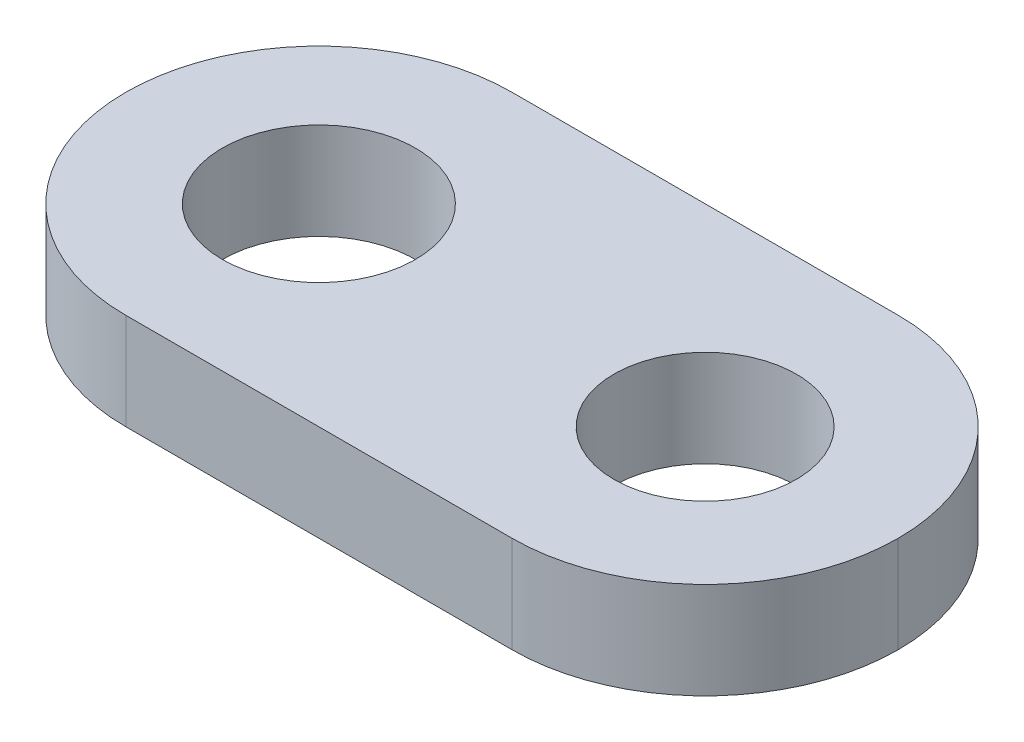
ISO-10303-21;
HEADER;
FILE_DESCRIPTION(('STEP AP214'),'2;1');
FILE_NAME('part.step','',(''),(''),'','','');
FILE_SCHEMA(('AUTOMOTIVE_DESIGN { 1 0 10303 214 1 1 1 1 }'));
ENDSEC;
DATA;
#1=APPLICATION_CONTEXT('core data for automotive mechanical design processes');
#2=APPLICATION_PROTOCOL_DEFINITION('international standard','automotive_design',2000,#1);
#3=PRODUCT_CONTEXT('',#1,'mechanical');
#4=PRODUCT('Part','Part','',(#3));
#5=PRODUCT_RELATED_PRODUCT_CATEGORY('part','',(#4));
#6=PRODUCT_DEFINITION_FORMATION('','',#4);
#7=PRODUCT_DEFINITION_CONTEXT('part definition',#1,'design');
#8=PRODUCT_DEFINITION('design','',#6,#7);
#9=PRODUCT_DEFINITION_SHAPE('','',#8);
#10=(LENGTH_UNIT() NAMED_UNIT(*) SI_UNIT(.MILLI.,.METRE.));
#11=(NAMED_UNIT(*) PLANE_ANGLE_UNIT() SI_UNIT($,.RADIAN.));
#12=(NAMED_UNIT(*) SI_UNIT($,.STERADIAN.) SOLID_ANGLE_UNIT());
#13=UNCERTAINTY_MEASURE_WITH_UNIT(LENGTH_MEASURE(1.E-05),#10,'distance_accuracy_value','');
#14=(GEOMETRIC_REPRESENTATION_CONTEXT(3) GLOBAL_UNCERTAINTY_ASSIGNED_CONTEXT((#13)) GLOBAL_UNIT_ASSIGNED_CONTEXT((#10,
#11,#12)) REPRESENTATION_CONTEXT('',''));
#15=CARTESIAN_POINT('',(0.,0.,0.));
#16=DIRECTION('',(0.,0.,1.));
#17=DIRECTION('',(1.,0.,0.));
#18=AXIS2_PLACEMENT_3D('',#15,#16,#17);
#19=CARTESIAN_POINT('',(0.,3.175,0.));
#20=DIRECTION('',(0.,-1.,0.));
#21=DIRECTION('',(0.,0.,-1.));
#22=AXIS2_PLACEMENT_3D('',#19,#20,#21);
#23=PLANE('',#22);
#24=DIRECTION('',(1.,0.,0.));
#25=VECTOR('',#24,1.);
#26=CARTESIAN_POINT('',(0.,3.175,0.));
#27=LINE('',#26,#25);
#28=CARTESIAN_POINT('',(6.35,3.175,0.));
#29=VERTEX_POINT('',#28);
#30=CARTESIAN_POINT('',(19.05,3.175,0.));
#31=VERTEX_POINT('',#30);
#32=EDGE_CURVE('E143',#29,#31,#27,.T.);
#33=ORIENTED_EDGE('',*,*,#32,.T.);
#34=CARTESIAN_POINT('',(19.05,3.175,-6.35));
#35=DIRECTION('',(0.,-1.,0.));
#36=DIRECTION('',(0.,0.,-1.));
#37=AXIS2_PLACEMENT_3D('',#34,#35,#36);
#38=CIRCLE('',#37,6.35);
#39=CARTESIAN_POINT('',(25.4,3.175,-6.35));
#40=VERTEX_POINT('',#39);
#41=EDGE_CURVE('E123',#31,#40,#38,.F.);
#42=ORIENTED_EDGE('',*,*,#41,.T.);
#43=CARTESIAN_POINT('',(19.05,3.175,-6.35));
#44=DIRECTION('',(0.,-1.,0.));
#45=DIRECTION('',(0.,0.,-1.));
#46=AXIS2_PLACEMENT_3D('',#43,#44,#45);
#47=CIRCLE('',#46,6.35);
#48=CARTESIAN_POINT('',(19.05,3.175,-12.7));
#49=VERTEX_POINT('',#48);
#50=EDGE_CURVE('E59',#40,#49,#47,.F.);
#51=ORIENTED_EDGE('',*,*,#50,.T.);
#52=DIRECTION('',(-1.,0.,0.));
#53=VECTOR('',#52,1.);
#54=CARTESIAN_POINT('',(0.,3.175,-12.7));
#55=LINE('',#54,#53);
#56=CARTESIAN_POINT('',(6.35,3.175,-12.7));
#57=VERTEX_POINT('',#56);
#58=EDGE_CURVE('E102',#49,#57,#55,.T.);
#59=ORIENTED_EDGE('',*,*,#58,.T.);
#60=CARTESIAN_POINT('',(6.35,3.175,-6.35));
#61=DIRECTION('',(0.,-1.,0.));
#62=DIRECTION('',(0.,0.,-1.));
#63=AXIS2_PLACEMENT_3D('',#60,#61,#62);
#64=CIRCLE('',#63,6.35);
#65=CARTESIAN_POINT('',(0.,3.175,-6.35));
#66=VERTEX_POINT('',#65);
#67=EDGE_CURVE('E51',#57,#66,#64,.F.);
#68=ORIENTED_EDGE('',*,*,#67,.T.);
#69=CARTESIAN_POINT('',(6.35,3.175,-6.35));
#70=DIRECTION('',(0.,-1.,0.));
#71=DIRECTION('',(0.,0.,-1.));
#72=AXIS2_PLACEMENT_3D('',#69,#70,#71);
#73=CIRCLE('',#72,6.35);
#74=EDGE_CURVE('E105',#66,#29,#73,.F.);
#75=ORIENTED_EDGE('',*,*,#74,.T.);
#76=EDGE_LOOP('',(#33,#42,#51,#59,#68,#75));
#77=FACE_BOUND('',#76,.T.);
#78=CARTESIAN_POINT('',(19.05,3.175,-6.35));
#79=DIRECTION('',(0.,1.,0.));
#80=DIRECTION('',(0.,0.,1.));
#81=AXIS2_PLACEMENT_3D('',#78,#79,#80);
#82=CIRCLE('',#81,2.99999999999999);
#83=CARTESIAN_POINT('',(19.05,3.175,-3.35000000000001));
#84=VERTEX_POINT('',#83);
#85=EDGE_CURVE('E138',#84,#84,#82,.T.);
#86=ORIENTED_EDGE('',*,*,#85,.F.);
#87=EDGE_LOOP('',(#86));
#88=FACE_BOUND('',#87,.T.);
#89=CARTESIAN_POINT('',(6.35,3.175,-6.35));
#90=DIRECTION('',(0.,1.,0.));
#91=DIRECTION('',(0.,0.,1.));
#92=AXIS2_PLACEMENT_3D('',#89,#90,#91);
#93=CIRCLE('',#92,3.175);
#94=CARTESIAN_POINT('',(6.35,3.175,-3.175));
#95=VERTEX_POINT('',#94);
#96=EDGE_CURVE('E131',#95,#95,#93,.T.);
#97=ORIENTED_EDGE('',*,*,#96,.F.);
#98=EDGE_LOOP('',(#97));
#99=FACE_BOUND('',#98,.T.);
#100=ADVANCED_FACE('F34',(#77,#88,#99),#23,.F.);
#101=CARTESIAN_POINT('',(0.,0.,0.));
#102=DIRECTION('',(0.,-1.,0.));
#103=DIRECTION('',(0.,0.,-1.));
#104=AXIS2_PLACEMENT_3D('',#101,#102,#103);
#105=PLANE('',#104);
#106=CARTESIAN_POINT('',(19.05,0.,-6.35));
#107=DIRECTION('',(0.,1.,0.));
#108=DIRECTION('',(0.,0.,1.));
#109=AXIS2_PLACEMENT_3D('',#106,#107,#108);
#110=CIRCLE('',#109,2.99999999999999);
#111=CARTESIAN_POINT('',(19.05,0.,-3.35000000000001));
#112=VERTEX_POINT('',#111);
#113=EDGE_CURVE('E135',#112,#112,#110,.T.);
#114=ORIENTED_EDGE('',*,*,#113,.T.);
#115=EDGE_LOOP('',(#114));
#116=FACE_BOUND('',#115,.T.);
#117=CARTESIAN_POINT('',(19.05,0.,-6.35));
#118=DIRECTION('',(0.,-1.,0.));
#119=DIRECTION('',(0.,0.,-1.));
#120=AXIS2_PLACEMENT_3D('',#117,#118,#119);
#121=CIRCLE('',#120,6.35);
#122=CARTESIAN_POINT('',(19.05,0.,-12.7));
#123=VERTEX_POINT('',#122);
#124=CARTESIAN_POINT('',(25.4,0.,-6.35));
#125=VERTEX_POINT('',#124);
#126=EDGE_CURVE('E108',#123,#125,#121,.T.);
#127=ORIENTED_EDGE('',*,*,#126,.T.);
#128=CARTESIAN_POINT('',(19.05,0.,-6.35));
#129=DIRECTION('',(0.,-1.,0.));
#130=DIRECTION('',(0.,0.,-1.));
#131=AXIS2_PLACEMENT_3D('',#128,#129,#130);
#132=CIRCLE('',#131,6.35);
#133=CARTESIAN_POINT('',(19.05,0.,0.));
#134=VERTEX_POINT('',#133);
#135=EDGE_CURVE('E110',#125,#134,#132,.T.);
#136=ORIENTED_EDGE('',*,*,#135,.T.);
#137=DIRECTION('',(1.,0.,0.));
#138=VECTOR('',#137,1.);
#139=CARTESIAN_POINT('',(0.,0.,0.));
#140=LINE('',#139,#138);
#141=CARTESIAN_POINT('',(6.35,0.,0.));
#142=VERTEX_POINT('',#141);
#143=EDGE_CURVE('E99',#142,#134,#140,.T.);
#144=ORIENTED_EDGE('',*,*,#143,.F.);
#145=CARTESIAN_POINT('',(6.35,0.,-6.35));
#146=DIRECTION('',(0.,-1.,0.));
#147=DIRECTION('',(0.,0.,-1.));
#148=AXIS2_PLACEMENT_3D('',#145,#146,#147);
#149=CIRCLE('',#148,6.35);
#150=CARTESIAN_POINT('',(0.,0.,-6.35));
#151=VERTEX_POINT('',#150);
#152=EDGE_CURVE('E90',#142,#151,#149,.T.);
#153=ORIENTED_EDGE('',*,*,#152,.T.);
#154=CARTESIAN_POINT('',(6.35,0.,-6.35));
#155=DIRECTION('',(0.,-1.,0.));
#156=DIRECTION('',(0.,0.,-1.));
#157=AXIS2_PLACEMENT_3D('',#154,#155,#156);
#158=CIRCLE('',#157,6.35);
#159=CARTESIAN_POINT('',(6.35,0.,-12.7));
#160=VERTEX_POINT('',#159);
#161=EDGE_CURVE('E96',#151,#160,#158,.T.);
#162=ORIENTED_EDGE('',*,*,#161,.T.);
#163=DIRECTION('',(-1.,0.,0.));
#164=VECTOR('',#163,1.);
#165=CARTESIAN_POINT('',(0.,0.,-12.7));
#166=LINE('',#165,#164);
#167=EDGE_CURVE('E146',#123,#160,#166,.T.);
#168=ORIENTED_EDGE('',*,*,#167,.F.);
#169=EDGE_LOOP('',(#127,#136,#144,#153,#162,#168));
#170=FACE_BOUND('',#169,.T.);
#171=CARTESIAN_POINT('',(6.35,0.,-6.35));
#172=DIRECTION('',(0.,1.,0.));
#173=DIRECTION('',(0.,0.,1.));
#174=AXIS2_PLACEMENT_3D('',#171,#172,#173);
#175=CIRCLE('',#174,3.175);
#176=CARTESIAN_POINT('',(6.35,0.,-3.175));
#177=VERTEX_POINT('',#176);
#178=EDGE_CURVE('E126',#177,#177,#175,.T.);
#179=ORIENTED_EDGE('',*,*,#178,.T.);
#180=EDGE_LOOP('',(#179));
#181=FACE_BOUND('',#180,.T.);
#182=ADVANCED_FACE('F92',(#116,#170,#181),#105,.T.);
#183=CARTESIAN_POINT('',(0.,3.175,0.));
#184=DIRECTION('',(0.,0.,-1.));
#185=DIRECTION('',(-1.,0.,0.));
#186=AXIS2_PLACEMENT_3D('',#183,#184,#185);
#187=PLANE('',#186);
#188=ORIENTED_EDGE('',*,*,#143,.T.);
#189=DIRECTION('',(0.,-1.,0.));
#190=VECTOR('',#189,1.);
#191=CARTESIAN_POINT('',(19.05,3.175,0.));
#192=LINE('',#191,#190);
#193=EDGE_CURVE('E117',#134,#31,#192,.F.);
#194=ORIENTED_EDGE('',*,*,#193,.T.);
#195=ORIENTED_EDGE('',*,*,#32,.F.);
#196=DIRECTION('',(0.,-1.,0.));
#197=VECTOR('',#196,1.);
#198=CARTESIAN_POINT('',(6.35,3.175,0.));
#199=LINE('',#198,#197);
#200=EDGE_CURVE('E115',#29,#142,#199,.T.);
#201=ORIENTED_EDGE('',*,*,#200,.T.);
#202=EDGE_LOOP('',(#188,#194,#195,#201));
#203=FACE_BOUND('',#202,.T.);
#204=ADVANCED_FACE('F157',(#203),#187,.F.);
#205=CARTESIAN_POINT('',(0.,3.175,-12.7));
#206=DIRECTION('',(0.,0.,1.));
#207=DIRECTION('',(1.,0.,0.));
#208=AXIS2_PLACEMENT_3D('',#205,#206,#207);
#209=PLANE('',#208);
#210=ORIENTED_EDGE('',*,*,#58,.F.);
#211=DIRECTION('',(0.,-1.,0.));
#212=VECTOR('',#211,1.);
#213=CARTESIAN_POINT('',(19.05,3.175,-12.7));
#214=LINE('',#213,#212);
#215=EDGE_CURVE('E11',#49,#123,#214,.T.);
#216=ORIENTED_EDGE('',*,*,#215,.T.);
#217=ORIENTED_EDGE('',*,*,#167,.T.);
#218=DIRECTION('',(0.,-1.,0.));
#219=VECTOR('',#218,1.);
#220=CARTESIAN_POINT('',(6.35,3.175,-12.7));
#221=LINE('',#220,#219);
#222=EDGE_CURVE('E43',#160,#57,#221,.F.);
#223=ORIENTED_EDGE('',*,*,#222,.T.);
#224=EDGE_LOOP('',(#210,#216,#217,#223));
#225=FACE_BOUND('',#224,.T.);
#226=ADVANCED_FACE('F149',(#225),#209,.F.);
#227=CARTESIAN_POINT('',(19.05,3.175,-6.35));
#228=DIRECTION('',(0.,-1.,0.));
#229=DIRECTION('',(0.,0.,-1.));
#230=AXIS2_PLACEMENT_3D('',#227,#228,#229);
#231=CYLINDRICAL_SURFACE('',#230,2.99999999999999);
#232=ORIENTED_EDGE('',*,*,#85,.T.);
#233=EDGE_LOOP('',(#232));
#234=FACE_BOUND('',#233,.T.);
#235=ORIENTED_EDGE('',*,*,#113,.F.);
#236=EDGE_LOOP('',(#235));
#237=FACE_BOUND('',#236,.T.);
#238=ADVANCED_FACE('F169',(#234,#237),#231,.F.);
#239=CARTESIAN_POINT('',(6.35,3.175,-6.35));
#240=DIRECTION('',(0.,-1.,0.));
#241=DIRECTION('',(0.,0.,-1.));
#242=AXIS2_PLACEMENT_3D('',#239,#240,#241);
#243=CYLINDRICAL_SURFACE('',#242,3.175);
#244=ORIENTED_EDGE('',*,*,#96,.T.);
#245=EDGE_LOOP('',(#244));
#246=FACE_BOUND('',#245,.T.);
#247=ORIENTED_EDGE('',*,*,#178,.F.);
#248=EDGE_LOOP('',(#247));
#249=FACE_BOUND('',#248,.T.);
#250=ADVANCED_FACE('F166',(#246,#249),#243,.F.);
#251=CARTESIAN_POINT('',(19.05,3.175,-6.35));
#252=DIRECTION('',(0.,-1.,0.));
#253=DIRECTION('',(0.,0.,-1.));
#254=AXIS2_PLACEMENT_3D('',#251,#252,#253);
#255=CYLINDRICAL_SURFACE('',#254,6.35);
#256=ORIENTED_EDGE('',*,*,#215,.F.);
#257=ORIENTED_EDGE('',*,*,#50,.F.);
#258=DIRECTION('',(0.,-1.,0.));
#259=VECTOR('',#258,1.);
#260=CARTESIAN_POINT('',(25.4,3.175,-6.35));
#261=LINE('',#260,#259);
#262=EDGE_CURVE('E106',#125,#40,#261,.F.);
#263=ORIENTED_EDGE('',*,*,#262,.F.);
#264=ORIENTED_EDGE('',*,*,#126,.F.);
#265=EDGE_LOOP('',(#256,#257,#263,#264));
#266=FACE_BOUND('',#265,.T.);
#267=ADVANCED_FACE('F153',(#266),#255,.T.);
#268=CARTESIAN_POINT('',(19.05,3.175,-6.35));
#269=DIRECTION('',(0.,-1.,0.));
#270=DIRECTION('',(0.,0.,-1.));
#271=AXIS2_PLACEMENT_3D('',#268,#269,#270);
#272=CYLINDRICAL_SURFACE('',#271,6.35);
#273=ORIENTED_EDGE('',*,*,#41,.F.);
#274=ORIENTED_EDGE('',*,*,#193,.F.);
#275=ORIENTED_EDGE('',*,*,#135,.F.);
#276=ORIENTED_EDGE('',*,*,#262,.T.);
#277=EDGE_LOOP('',(#273,#274,#275,#276));
#278=FACE_BOUND('',#277,.T.);
#279=ADVANCED_FACE('F155',(#278),#272,.T.);
#280=CARTESIAN_POINT('',(6.35,3.175,-6.35));
#281=DIRECTION('',(0.,-1.,0.));
#282=DIRECTION('',(0.,0.,-1.));
#283=AXIS2_PLACEMENT_3D('',#280,#281,#282);
#284=CYLINDRICAL_SURFACE('',#283,6.35);
#285=ORIENTED_EDGE('',*,*,#200,.F.);
#286=ORIENTED_EDGE('',*,*,#74,.F.);
#287=DIRECTION('',(0.,-1.,0.));
#288=VECTOR('',#287,1.);
#289=CARTESIAN_POINT('',(0.,3.175,-6.35));
#290=LINE('',#289,#288);
#291=EDGE_CURVE('E38',#151,#66,#290,.F.);
#292=ORIENTED_EDGE('',*,*,#291,.F.);
#293=ORIENTED_EDGE('',*,*,#152,.F.);
#294=EDGE_LOOP('',(#285,#286,#292,#293));
#295=FACE_BOUND('',#294,.T.);
#296=ADVANCED_FACE('F36',(#295),#284,.T.);
#297=CARTESIAN_POINT('',(6.35,3.175,-6.35));
#298=DIRECTION('',(0.,-1.,0.));
#299=DIRECTION('',(0.,0.,-1.));
#300=AXIS2_PLACEMENT_3D('',#297,#298,#299);
#301=CYLINDRICAL_SURFACE('',#300,6.35);
#302=ORIENTED_EDGE('',*,*,#67,.F.);
#303=ORIENTED_EDGE('',*,*,#222,.F.);
#304=ORIENTED_EDGE('',*,*,#161,.F.);
#305=ORIENTED_EDGE('',*,*,#291,.T.);
#306=EDGE_LOOP('',(#302,#303,#304,#305));
#307=FACE_BOUND('',#306,.T.);
#308=ADVANCED_FACE('F107',(#307),#301,.T.);
#309=CLOSED_SHELL('',(#100,#182,#204,#226,#238,#250,#267,#279,#296,#308));
#310=MANIFOLD_SOLID_BREP('B2',#309);
#311=ADVANCED_BREP_SHAPE_REPRESENTATION('',(#18,#310),#14);
#312=SHAPE_DEFINITION_REPRESENTATION(#9,#311);
ENDSEC;
END-ISO-10303-21;
